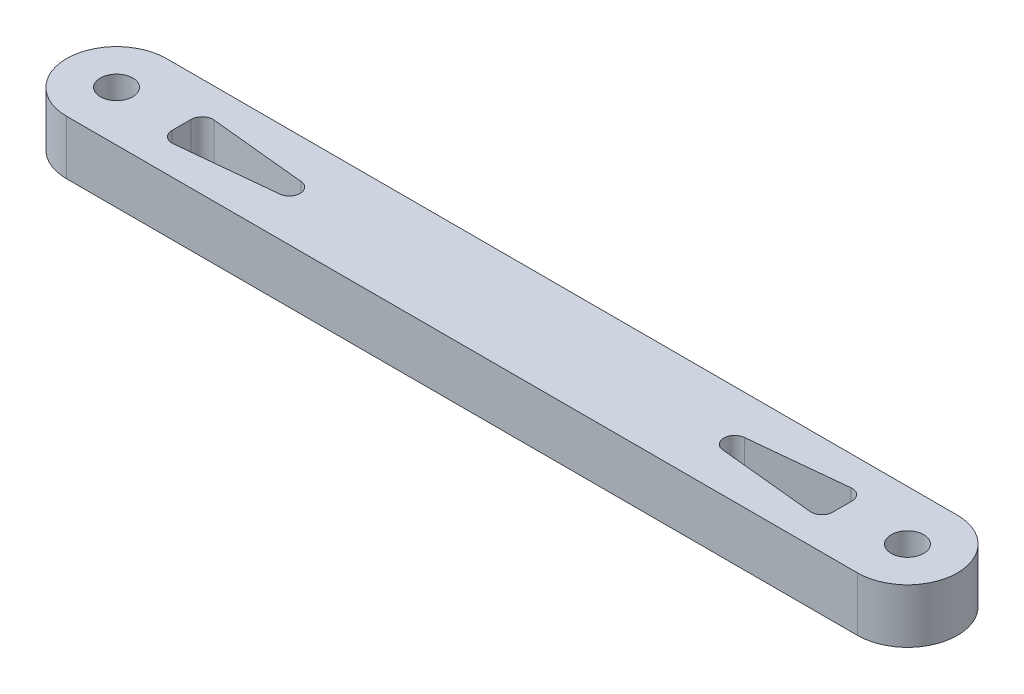
ISO-10303-21;
HEADER;
FILE_DESCRIPTION(('STEP AP214'),'2;1');
FILE_NAME('part.step','',(''),(''),'','','');
FILE_SCHEMA(('AUTOMOTIVE_DESIGN { 1 0 10303 214 1 1 1 1 }'));
ENDSEC;
DATA;
#1=APPLICATION_CONTEXT('core data for automotive mechanical design processes');
#2=APPLICATION_PROTOCOL_DEFINITION('international standard','automotive_design',2000,#1);
#3=PRODUCT_CONTEXT('',#1,'mechanical');
#4=PRODUCT('Part','Part','',(#3));
#5=PRODUCT_RELATED_PRODUCT_CATEGORY('part','',(#4));
#6=PRODUCT_DEFINITION_FORMATION('','',#4);
#7=PRODUCT_DEFINITION_CONTEXT('part definition',#1,'design');
#8=PRODUCT_DEFINITION('design','',#6,#7);
#9=PRODUCT_DEFINITION_SHAPE('','',#8);
#10=(LENGTH_UNIT() NAMED_UNIT(*) SI_UNIT(.MILLI.,.METRE.));
#11=(NAMED_UNIT(*) PLANE_ANGLE_UNIT() SI_UNIT($,.RADIAN.));
#12=(NAMED_UNIT(*) SI_UNIT($,.STERADIAN.) SOLID_ANGLE_UNIT());
#13=UNCERTAINTY_MEASURE_WITH_UNIT(LENGTH_MEASURE(1.E-05),#10,'distance_accuracy_value','');
#14=(GEOMETRIC_REPRESENTATION_CONTEXT(3) GLOBAL_UNCERTAINTY_ASSIGNED_CONTEXT((#13)) GLOBAL_UNIT_ASSIGNED_CONTEXT((#10,
#11,#12)) REPRESENTATION_CONTEXT('',''));
#15=CARTESIAN_POINT('',(0.,0.,0.));
#16=DIRECTION('',(0.,0.,1.));
#17=DIRECTION('',(1.,0.,0.));
#18=AXIS2_PLACEMENT_3D('',#15,#16,#17);
#19=CARTESIAN_POINT('',(73.,5.,0.));
#20=DIRECTION('',(0.,-1.,0.));
#21=DIRECTION('',(0.,0.,1.));
#22=AXIS2_PLACEMENT_3D('',#19,#20,#21);
#23=CYLINDRICAL_SURFACE('',#22,1.5);
#24=CARTESIAN_POINT('',(73.,5.,0.));
#25=DIRECTION('',(0.,-1.,0.));
#26=DIRECTION('',(0.,0.,-1.));
#27=AXIS2_PLACEMENT_3D('',#24,#25,#26);
#28=CIRCLE('',#27,1.5);
#29=CARTESIAN_POINT('',(73.,5.,-1.5));
#30=VERTEX_POINT('',#29);
#31=EDGE_CURVE('E167',#30,#30,#28,.T.);
#32=ORIENTED_EDGE('',*,*,#31,.F.);
#33=EDGE_LOOP('',(#32));
#34=FACE_BOUND('',#33,.T.);
#35=CARTESIAN_POINT('',(73.,0.,0.));
#36=DIRECTION('',(0.,-1.,0.));
#37=DIRECTION('',(0.,0.,-1.));
#38=AXIS2_PLACEMENT_3D('',#35,#36,#37);
#39=CIRCLE('',#38,1.5);
#40=CARTESIAN_POINT('',(73.,0.,-1.5));
#41=VERTEX_POINT('',#40);
#42=EDGE_CURVE('E291',#41,#41,#39,.T.);
#43=ORIENTED_EDGE('',*,*,#42,.T.);
#44=EDGE_LOOP('',(#43));
#45=FACE_BOUND('',#44,.T.);
#46=ADVANCED_FACE('F43',(#34,#45),#23,.F.);
#47=CARTESIAN_POINT('',(0.,0.,0.));
#48=DIRECTION('',(0.,1.,0.));
#49=DIRECTION('',(0.,0.,-1.));
#50=AXIS2_PLACEMENT_3D('',#47,#48,#49);
#51=PLANE('',#50);
#52=DIRECTION('',(0.,0.,-1.));
#53=VECTOR('',#52,1.);
#54=CARTESIAN_POINT('',(6.,0.,0.));
#55=LINE('',#54,#53);
#56=CARTESIAN_POINT('',(6.,0.,0.895012437887911));
#57=VERTEX_POINT('',#56);
#58=CARTESIAN_POINT('',(6.,0.,-0.895012437887911));
#59=VERTEX_POINT('',#58);
#60=EDGE_CURVE('E272',#57,#59,#55,.T.);
#61=ORIENTED_EDGE('',*,*,#60,.F.);
#62=CARTESIAN_POINT('',(7.,0.,0.895012437887911));
#63=DIRECTION('',(0.,-1.,0.));
#64=DIRECTION('',(0.,0.,-1.));
#65=AXIS2_PLACEMENT_3D('',#62,#63,#64);
#66=CIRCLE('',#65,1.);
#67=CARTESIAN_POINT('',(7.099503719021,0.,1.8900496280979));
#68=VERTEX_POINT('',#67);
#69=EDGE_CURVE('E11',#68,#57,#66,.T.);
#70=ORIENTED_EDGE('',*,*,#69,.F.);
#71=DIRECTION('',(-0.995037190209989,0.,0.0995037190209989));
#72=VECTOR('',#71,1.);
#73=CARTESIAN_POINT('',(0.257425742574257,0.,2.57425742574257));
#74=LINE('',#73,#72);
#75=CARTESIAN_POINT('',(16.0496280979001,0.,0.995037190209989));
#76=VERTEX_POINT('',#75);
#77=EDGE_CURVE('E277',#76,#68,#74,.T.);
#78=ORIENTED_EDGE('',*,*,#77,.F.);
#79=CARTESIAN_POINT('',(15.9501243788791,0.,0.));
#80=DIRECTION('',(0.,-1.,0.));
#81=DIRECTION('',(0.,0.,-1.));
#82=AXIS2_PLACEMENT_3D('',#79,#80,#81);
#83=CIRCLE('',#82,1.);
#84=CARTESIAN_POINT('',(16.0496280979001,0.,-0.995037190209989));
#85=VERTEX_POINT('',#84);
#86=EDGE_CURVE('E229',#85,#76,#83,.T.);
#87=ORIENTED_EDGE('',*,*,#86,.F.);
#88=DIRECTION('',(0.995037190209989,0.,0.0995037190209989));
#89=VECTOR('',#88,1.);
#90=CARTESIAN_POINT('',(0.257425742574257,0.,-2.57425742574257));
#91=LINE('',#90,#89);
#92=CARTESIAN_POINT('',(7.099503719021,0.,-1.8900496280979));
#93=VERTEX_POINT('',#92);
#94=EDGE_CURVE('E274',#93,#85,#91,.T.);
#95=ORIENTED_EDGE('',*,*,#94,.F.);
#96=CARTESIAN_POINT('',(7.,0.,-0.895012437887911));
#97=DIRECTION('',(0.,-1.,0.));
#98=DIRECTION('',(0.,0.,-1.));
#99=AXIS2_PLACEMENT_3D('',#96,#97,#98);
#100=CIRCLE('',#99,1.);
#101=EDGE_CURVE('E234',#59,#93,#100,.T.);
#102=ORIENTED_EDGE('',*,*,#101,.F.);
#103=EDGE_LOOP('',(#61,#70,#78,#87,#95,#102));
#104=FACE_BOUND('',#103,.T.);
#105=DIRECTION('',(0.995037190209989,0.,-0.0995037190209994));
#106=VECTOR('',#105,1.);
#107=CARTESIAN_POINT('',(0.46534653465347,0.,4.65346534653468));
#108=LINE('',#107,#106);
#109=CARTESIAN_POINT('',(56.9503719020999,0.,-0.995037190209986));
#110=VERTEX_POINT('',#109);
#111=CARTESIAN_POINT('',(65.900496280979,0.,-1.89004962809791));
#112=VERTEX_POINT('',#111);
#113=EDGE_CURVE('E258',#110,#112,#108,.T.);
#114=ORIENTED_EDGE('',*,*,#113,.F.);
#115=CARTESIAN_POINT('',(57.0498756211208,0.,0.));
#116=DIRECTION('',(0.,-1.,0.));
#117=DIRECTION('',(0.,0.,-1.));
#118=AXIS2_PLACEMENT_3D('',#115,#116,#117);
#119=CIRCLE('',#118,1.);
#120=CARTESIAN_POINT('',(56.9503719020999,0.,0.995037190209991));
#121=VERTEX_POINT('',#120);
#122=EDGE_CURVE('E223',#121,#110,#119,.T.);
#123=ORIENTED_EDGE('',*,*,#122,.F.);
#124=DIRECTION('',(-0.995037190209989,0.,-0.0995037190209991));
#125=VECTOR('',#124,1.);
#126=CARTESIAN_POINT('',(0.465346534653467,0.,-4.65346534653466));
#127=LINE('',#126,#125);
#128=CARTESIAN_POINT('',(65.900496280979,0.,1.89004962809791));
#129=VERTEX_POINT('',#128);
#130=EDGE_CURVE('E269',#129,#121,#127,.T.);
#131=ORIENTED_EDGE('',*,*,#130,.F.);
#132=CARTESIAN_POINT('',(66.,0.,0.895012437887918));
#133=DIRECTION('',(0.,-1.,0.));
#134=DIRECTION('',(0.,0.,-1.));
#135=AXIS2_PLACEMENT_3D('',#132,#133,#134);
#136=CIRCLE('',#135,1.);
#137=CARTESIAN_POINT('',(67.,0.,0.895012437887918));
#138=VERTEX_POINT('',#137);
#139=EDGE_CURVE('E217',#138,#129,#136,.T.);
#140=ORIENTED_EDGE('',*,*,#139,.F.);
#141=DIRECTION('',(0.,0.,1.));
#142=VECTOR('',#141,1.);
#143=CARTESIAN_POINT('',(67.,0.,0.));
#144=LINE('',#143,#142);
#145=CARTESIAN_POINT('',(67.,0.,-0.895012437887918));
#146=VERTEX_POINT('',#145);
#147=EDGE_CURVE('E266',#146,#138,#144,.T.);
#148=ORIENTED_EDGE('',*,*,#147,.F.);
#149=CARTESIAN_POINT('',(66.,0.,-0.895012437887918));
#150=DIRECTION('',(0.,-1.,0.));
#151=DIRECTION('',(0.,0.,-1.));
#152=AXIS2_PLACEMENT_3D('',#149,#150,#151);
#153=CIRCLE('',#152,1.);
#154=EDGE_CURVE('E211',#112,#146,#153,.T.);
#155=ORIENTED_EDGE('',*,*,#154,.F.);
#156=EDGE_LOOP('',(#114,#123,#131,#140,#148,#155));
#157=FACE_BOUND('',#156,.T.);
#158=CARTESIAN_POINT('',(0.,0.,0.));
#159=DIRECTION('',(0.,-1.,0.));
#160=DIRECTION('',(0.,0.,-1.));
#161=AXIS2_PLACEMENT_3D('',#158,#159,#160);
#162=CIRCLE('',#161,1.5);
#163=CARTESIAN_POINT('',(0.,0.,-1.5));
#164=VERTEX_POINT('',#163);
#165=EDGE_CURVE('E279',#164,#164,#162,.T.);
#166=ORIENTED_EDGE('',*,*,#165,.F.);
#167=EDGE_LOOP('',(#166));
#168=FACE_BOUND('',#167,.T.);
#169=ORIENTED_EDGE('',*,*,#42,.F.);
#170=EDGE_LOOP('',(#169));
#171=FACE_BOUND('',#170,.T.);
#172=DIRECTION('',(1.,0.,0.));
#173=VECTOR('',#172,1.);
#174=CARTESIAN_POINT('',(0.,0.,-4.61059088650664));
#175=LINE('',#174,#173);
#176=CARTESIAN_POINT('',(0.,0.,-4.61059088650664));
#177=VERTEX_POINT('',#176);
#178=CARTESIAN_POINT('',(73.,0.,-4.61059088650664));
#179=VERTEX_POINT('',#178);
#180=EDGE_CURVE('E294',#177,#179,#175,.T.);
#181=ORIENTED_EDGE('',*,*,#180,.T.);
#182=CARTESIAN_POINT('',(73.,0.,0.));
#183=DIRECTION('',(0.,-1.,0.));
#184=DIRECTION('',(0.,0.,-1.));
#185=AXIS2_PLACEMENT_3D('',#182,#183,#184);
#186=CIRCLE('',#185,4.61059088650664);
#187=CARTESIAN_POINT('',(73.,0.,4.61059088650664));
#188=VERTEX_POINT('',#187);
#189=EDGE_CURVE('E178',#179,#188,#186,.T.);
#190=ORIENTED_EDGE('',*,*,#189,.T.);
#191=DIRECTION('',(1.,0.,0.));
#192=VECTOR('',#191,1.);
#193=CARTESIAN_POINT('',(0.,0.,4.61059088650664));
#194=LINE('',#193,#192);
#195=CARTESIAN_POINT('',(0.,0.,4.61059088650664));
#196=VERTEX_POINT('',#195);
#197=EDGE_CURVE('E297',#196,#188,#194,.T.);
#198=ORIENTED_EDGE('',*,*,#197,.F.);
#199=CARTESIAN_POINT('',(0.,0.,0.));
#200=DIRECTION('',(0.,-1.,0.));
#201=DIRECTION('',(0.,0.,-1.));
#202=AXIS2_PLACEMENT_3D('',#199,#200,#201);
#203=CIRCLE('',#202,4.61059088650664);
#204=EDGE_CURVE('E283',#196,#177,#203,.T.);
#205=ORIENTED_EDGE('',*,*,#204,.T.);
#206=EDGE_LOOP('',(#181,#190,#198,#205));
#207=FACE_BOUND('',#206,.T.);
#208=ADVANCED_FACE('F310',(#104,#157,#168,#171,#207),#51,.F.);
#209=CARTESIAN_POINT('',(0.,5.,0.));
#210=DIRECTION('',(0.,-1.,0.));
#211=DIRECTION('',(0.,0.,1.));
#212=AXIS2_PLACEMENT_3D('',#209,#210,#211);
#213=CYLINDRICAL_SURFACE('',#212,1.5);
#214=CARTESIAN_POINT('',(0.,5.,0.));
#215=DIRECTION('',(0.,-1.,0.));
#216=DIRECTION('',(0.,0.,-1.));
#217=AXIS2_PLACEMENT_3D('',#214,#215,#216);
#218=CIRCLE('',#217,1.5);
#219=CARTESIAN_POINT('',(0.,5.,-1.5));
#220=VERTEX_POINT('',#219);
#221=EDGE_CURVE('E280',#220,#220,#218,.T.);
#222=ORIENTED_EDGE('',*,*,#221,.F.);
#223=EDGE_LOOP('',(#222));
#224=FACE_BOUND('',#223,.T.);
#225=ORIENTED_EDGE('',*,*,#165,.T.);
#226=EDGE_LOOP('',(#225));
#227=FACE_BOUND('',#226,.T.);
#228=ADVANCED_FACE('F312',(#224,#227),#213,.F.);
#229=CARTESIAN_POINT('',(0.,5.,4.61059088650664));
#230=DIRECTION('',(0.,0.,1.));
#231=DIRECTION('',(-1.,0.,0.));
#232=AXIS2_PLACEMENT_3D('',#229,#230,#231);
#233=PLANE('',#232);
#234=ORIENTED_EDGE('',*,*,#197,.T.);
#235=DIRECTION('',(0.,-1.,0.));
#236=VECTOR('',#235,1.);
#237=CARTESIAN_POINT('',(73.,5.,4.61059088650664));
#238=LINE('',#237,#236);
#239=CARTESIAN_POINT('',(73.,5.,4.61059088650664));
#240=VERTEX_POINT('',#239);
#241=EDGE_CURVE('E181',#240,#188,#238,.T.);
#242=ORIENTED_EDGE('',*,*,#241,.F.);
#243=DIRECTION('',(1.,0.,0.));
#244=VECTOR('',#243,1.);
#245=CARTESIAN_POINT('',(0.,5.,4.61059088650664));
#246=LINE('',#245,#244);
#247=CARTESIAN_POINT('',(0.,5.,4.61059088650664));
#248=VERTEX_POINT('',#247);
#249=EDGE_CURVE('E172',#248,#240,#246,.T.);
#250=ORIENTED_EDGE('',*,*,#249,.F.);
#251=DIRECTION('',(0.,-1.,0.));
#252=VECTOR('',#251,1.);
#253=CARTESIAN_POINT('',(0.,5.,4.61059088650664));
#254=LINE('',#253,#252);
#255=EDGE_CURVE('E185',#248,#196,#254,.T.);
#256=ORIENTED_EDGE('',*,*,#255,.T.);
#257=EDGE_LOOP('',(#234,#242,#250,#256));
#258=FACE_BOUND('',#257,.T.);
#259=ADVANCED_FACE('F305',(#258),#233,.T.);
#260=CARTESIAN_POINT('',(73.,5.,0.));
#261=DIRECTION('',(0.,-1.,0.));
#262=DIRECTION('',(0.,0.,1.));
#263=AXIS2_PLACEMENT_3D('',#260,#261,#262);
#264=CYLINDRICAL_SURFACE('',#263,4.61059088650664);
#265=ORIENTED_EDGE('',*,*,#189,.F.);
#266=DIRECTION('',(0.,-1.,0.));
#267=VECTOR('',#266,1.);
#268=CARTESIAN_POINT('',(73.,5.,-4.61059088650664));
#269=LINE('',#268,#267);
#270=CARTESIAN_POINT('',(73.,5.,-4.61059088650664));
#271=VERTEX_POINT('',#270);
#272=EDGE_CURVE('E162',#271,#179,#269,.T.);
#273=ORIENTED_EDGE('',*,*,#272,.F.);
#274=CARTESIAN_POINT('',(73.,5.,0.));
#275=DIRECTION('',(0.,-1.,0.));
#276=DIRECTION('',(0.,0.,-1.));
#277=AXIS2_PLACEMENT_3D('',#274,#275,#276);
#278=CIRCLE('',#277,4.61059088650664);
#279=EDGE_CURVE('E166',#271,#240,#278,.T.);
#280=ORIENTED_EDGE('',*,*,#279,.T.);
#281=ORIENTED_EDGE('',*,*,#241,.T.);
#282=EDGE_LOOP('',(#265,#273,#280,#281));
#283=FACE_BOUND('',#282,.T.);
#284=ADVANCED_FACE('F176',(#283),#264,.T.);
#285=CARTESIAN_POINT('',(0.,5.,-4.61059088650664));
#286=DIRECTION('',(0.,0.,1.));
#287=DIRECTION('',(-1.,0.,0.));
#288=AXIS2_PLACEMENT_3D('',#285,#286,#287);
#289=PLANE('',#288);
#290=ORIENTED_EDGE('',*,*,#180,.F.);
#291=DIRECTION('',(0.,-1.,0.));
#292=VECTOR('',#291,1.);
#293=CARTESIAN_POINT('',(0.,5.,-4.61059088650664));
#294=LINE('',#293,#292);
#295=CARTESIAN_POINT('',(0.,5.,-4.61059088650664));
#296=VERTEX_POINT('',#295);
#297=EDGE_CURVE('E164',#296,#177,#294,.T.);
#298=ORIENTED_EDGE('',*,*,#297,.F.);
#299=DIRECTION('',(1.,0.,0.));
#300=VECTOR('',#299,1.);
#301=CARTESIAN_POINT('',(0.,5.,-4.61059088650664));
#302=LINE('',#301,#300);
#303=EDGE_CURVE('E157',#296,#271,#302,.T.);
#304=ORIENTED_EDGE('',*,*,#303,.T.);
#305=ORIENTED_EDGE('',*,*,#272,.T.);
#306=EDGE_LOOP('',(#290,#298,#304,#305));
#307=FACE_BOUND('',#306,.T.);
#308=ADVANCED_FACE('F160',(#307),#289,.F.);
#309=CARTESIAN_POINT('',(0.,5.,0.));
#310=DIRECTION('',(0.,-1.,0.));
#311=DIRECTION('',(0.,0.,1.));
#312=AXIS2_PLACEMENT_3D('',#309,#310,#311);
#313=CYLINDRICAL_SURFACE('',#312,4.61059088650664);
#314=ORIENTED_EDGE('',*,*,#204,.F.);
#315=ORIENTED_EDGE('',*,*,#255,.F.);
#316=CARTESIAN_POINT('',(0.,5.,0.));
#317=DIRECTION('',(0.,-1.,0.));
#318=DIRECTION('',(0.,0.,-1.));
#319=AXIS2_PLACEMENT_3D('',#316,#317,#318);
#320=CIRCLE('',#319,4.61059088650664);
#321=EDGE_CURVE('E287',#248,#296,#320,.T.);
#322=ORIENTED_EDGE('',*,*,#321,.T.);
#323=ORIENTED_EDGE('',*,*,#297,.T.);
#324=EDGE_LOOP('',(#314,#315,#322,#323));
#325=FACE_BOUND('',#324,.T.);
#326=ADVANCED_FACE('F308',(#325),#313,.T.);
#327=CARTESIAN_POINT('',(0.,5.,0.));
#328=DIRECTION('',(0.,1.,0.));
#329=DIRECTION('',(0.,0.,-1.));
#330=AXIS2_PLACEMENT_3D('',#327,#328,#329);
#331=PLANE('',#330);
#332=DIRECTION('',(-0.995037190209989,0.,0.0995037190209989));
#333=VECTOR('',#332,1.);
#334=CARTESIAN_POINT('',(6.,5.,2.));
#335=LINE('',#334,#333);
#336=CARTESIAN_POINT('',(16.0496280979001,5.,0.995037190209989));
#337=VERTEX_POINT('',#336);
#338=CARTESIAN_POINT('',(7.099503719021,5.,1.8900496280979));
#339=VERTEX_POINT('',#338);
#340=EDGE_CURVE('E244',#337,#339,#335,.T.);
#341=ORIENTED_EDGE('',*,*,#340,.T.);
#342=CARTESIAN_POINT('',(7.,5.,0.895012437887911));
#343=DIRECTION('',(0.,-1.,0.));
#344=DIRECTION('',(0.,0.,-1.));
#345=AXIS2_PLACEMENT_3D('',#342,#343,#344);
#346=CIRCLE('',#345,1.);
#347=CARTESIAN_POINT('',(6.,5.,0.895012437887911));
#348=VERTEX_POINT('',#347);
#349=EDGE_CURVE('E51',#348,#339,#346,.F.);
#350=ORIENTED_EDGE('',*,*,#349,.F.);
#351=DIRECTION('',(0.,0.,-1.));
#352=VECTOR('',#351,1.);
#353=CARTESIAN_POINT('',(6.,5.,2.));
#354=LINE('',#353,#352);
#355=CARTESIAN_POINT('',(6.,5.,-0.895012437887911));
#356=VERTEX_POINT('',#355);
#357=EDGE_CURVE('E248',#348,#356,#354,.T.);
#358=ORIENTED_EDGE('',*,*,#357,.T.);
#359=CARTESIAN_POINT('',(7.,5.,-0.895012437887911));
#360=DIRECTION('',(0.,-1.,0.));
#361=DIRECTION('',(0.,0.,-1.));
#362=AXIS2_PLACEMENT_3D('',#359,#360,#361);
#363=CIRCLE('',#362,1.);
#364=CARTESIAN_POINT('',(7.099503719021,5.,-1.8900496280979));
#365=VERTEX_POINT('',#364);
#366=EDGE_CURVE('E232',#365,#356,#363,.F.);
#367=ORIENTED_EDGE('',*,*,#366,.F.);
#368=DIRECTION('',(0.995037190209989,0.,0.0995037190209989));
#369=VECTOR('',#368,1.);
#370=CARTESIAN_POINT('',(6.,5.,-2.));
#371=LINE('',#370,#369);
#372=CARTESIAN_POINT('',(16.0496280979001,5.,-0.995037190209989));
#373=VERTEX_POINT('',#372);
#374=EDGE_CURVE('E251',#365,#373,#371,.T.);
#375=ORIENTED_EDGE('',*,*,#374,.T.);
#376=CARTESIAN_POINT('',(15.9501243788791,5.,0.));
#377=DIRECTION('',(0.,-1.,0.));
#378=DIRECTION('',(0.,0.,-1.));
#379=AXIS2_PLACEMENT_3D('',#376,#377,#378);
#380=CIRCLE('',#379,1.);
#381=EDGE_CURVE('E226',#337,#373,#380,.F.);
#382=ORIENTED_EDGE('',*,*,#381,.F.);
#383=EDGE_LOOP('',(#341,#350,#358,#367,#375,#382));
#384=FACE_BOUND('',#383,.T.);
#385=DIRECTION('',(-0.995037190209989,0.,-0.0995037190209991));
#386=VECTOR('',#385,1.);
#387=CARTESIAN_POINT('',(67.,5.,2.00000000000001));
#388=LINE('',#387,#386);
#389=CARTESIAN_POINT('',(65.900496280979,5.,1.89004962809791));
#390=VERTEX_POINT('',#389);
#391=CARTESIAN_POINT('',(56.9503719020999,5.,0.99503719020999));
#392=VERTEX_POINT('',#391);
#393=EDGE_CURVE('E249',#390,#392,#388,.T.);
#394=ORIENTED_EDGE('',*,*,#393,.T.);
#395=CARTESIAN_POINT('',(57.0498756211208,5.,0.));
#396=DIRECTION('',(0.,-1.,0.));
#397=DIRECTION('',(0.,0.,-1.));
#398=AXIS2_PLACEMENT_3D('',#395,#396,#397);
#399=CIRCLE('',#398,1.);
#400=CARTESIAN_POINT('',(56.9503719020999,5.,-0.995037190209988));
#401=VERTEX_POINT('',#400);
#402=EDGE_CURVE('E220',#401,#392,#399,.F.);
#403=ORIENTED_EDGE('',*,*,#402,.F.);
#404=DIRECTION('',(0.995037190209989,0.,-0.0995037190209994));
#405=VECTOR('',#404,1.);
#406=CARTESIAN_POINT('',(67.,5.,-2.00000000000001));
#407=LINE('',#406,#405);
#408=CARTESIAN_POINT('',(65.900496280979,5.,-1.89004962809791));
#409=VERTEX_POINT('',#408);
#410=EDGE_CURVE('E254',#401,#409,#407,.T.);
#411=ORIENTED_EDGE('',*,*,#410,.T.);
#412=CARTESIAN_POINT('',(66.,5.,-0.895012437887918));
#413=DIRECTION('',(0.,-1.,0.));
#414=DIRECTION('',(0.,0.,-1.));
#415=AXIS2_PLACEMENT_3D('',#412,#413,#414);
#416=CIRCLE('',#415,1.);
#417=CARTESIAN_POINT('',(67.,5.,-0.895012437887918));
#418=VERTEX_POINT('',#417);
#419=EDGE_CURVE('E208',#418,#409,#416,.F.);
#420=ORIENTED_EDGE('',*,*,#419,.F.);
#421=DIRECTION('',(0.,0.,1.));
#422=VECTOR('',#421,1.);
#423=CARTESIAN_POINT('',(67.,5.,2.00000000000001));
#424=LINE('',#423,#422);
#425=CARTESIAN_POINT('',(67.,5.,0.895012437887918));
#426=VERTEX_POINT('',#425);
#427=EDGE_CURVE('E259',#418,#426,#424,.T.);
#428=ORIENTED_EDGE('',*,*,#427,.T.);
#429=CARTESIAN_POINT('',(66.,5.,0.895012437887918));
#430=DIRECTION('',(0.,-1.,0.));
#431=DIRECTION('',(0.,0.,-1.));
#432=AXIS2_PLACEMENT_3D('',#429,#430,#431);
#433=CIRCLE('',#432,1.);
#434=EDGE_CURVE('E214',#390,#426,#433,.F.);
#435=ORIENTED_EDGE('',*,*,#434,.F.);
#436=EDGE_LOOP('',(#394,#403,#411,#420,#428,#435));
#437=FACE_BOUND('',#436,.T.);
#438=ORIENTED_EDGE('',*,*,#221,.T.);
#439=EDGE_LOOP('',(#438));
#440=FACE_BOUND('',#439,.T.);
#441=ORIENTED_EDGE('',*,*,#31,.T.);
#442=EDGE_LOOP('',(#441));
#443=FACE_BOUND('',#442,.T.);
#444=ORIENTED_EDGE('',*,*,#303,.F.);
#445=ORIENTED_EDGE('',*,*,#321,.F.);
#446=ORIENTED_EDGE('',*,*,#249,.T.);
#447=ORIENTED_EDGE('',*,*,#279,.F.);
#448=EDGE_LOOP('',(#444,#445,#446,#447));
#449=FACE_BOUND('',#448,.T.);
#450=ADVANCED_FACE('F170',(#384,#437,#440,#443,#449),#331,.T.);
#451=CARTESIAN_POINT('',(67.,-12.,2.00000000000001));
#452=DIRECTION('',(-0.0995037190209991,0.,0.995037190209989));
#453=DIRECTION('',(-0.995037190209989,0.,-0.0995037190209991));
#454=AXIS2_PLACEMENT_3D('',#451,#452,#453);
#455=PLANE('',#454);
#456=ORIENTED_EDGE('',*,*,#130,.T.);
#457=DIRECTION('',(0.,1.,0.));
#458=VECTOR('',#457,1.);
#459=CARTESIAN_POINT('',(56.9503719020999,0.,0.99503719020999));
#460=LINE('',#459,#458);
#461=EDGE_CURVE('E194',#392,#121,#460,.F.);
#462=ORIENTED_EDGE('',*,*,#461,.F.);
#463=ORIENTED_EDGE('',*,*,#393,.F.);
#464=DIRECTION('',(0.,1.,0.));
#465=VECTOR('',#464,1.);
#466=CARTESIAN_POINT('',(65.900496280979,4.99999999999999,1.89004962809791));
#467=LINE('',#466,#465);
#468=EDGE_CURVE('E196',#129,#390,#467,.T.);
#469=ORIENTED_EDGE('',*,*,#468,.F.);
#470=EDGE_LOOP('',(#456,#462,#463,#469));
#471=FACE_BOUND('',#470,.T.);
#472=ADVANCED_FACE('F379',(#471),#455,.F.);
#473=CARTESIAN_POINT('',(67.,-12.,2.00000000000001));
#474=DIRECTION('',(1.,0.,0.));
#475=DIRECTION('',(0.,0.,1.));
#476=AXIS2_PLACEMENT_3D('',#473,#474,#475);
#477=PLANE('',#476);
#478=ORIENTED_EDGE('',*,*,#147,.T.);
#479=DIRECTION('',(0.,1.,0.));
#480=VECTOR('',#479,1.);
#481=CARTESIAN_POINT('',(67.,0.,0.895012437887918));
#482=LINE('',#481,#480);
#483=EDGE_CURVE('E180',#426,#138,#482,.F.);
#484=ORIENTED_EDGE('',*,*,#483,.F.);
#485=ORIENTED_EDGE('',*,*,#427,.F.);
#486=DIRECTION('',(0.,1.,0.));
#487=VECTOR('',#486,1.);
#488=CARTESIAN_POINT('',(67.,4.99999999999999,-0.895012437887918));
#489=LINE('',#488,#487);
#490=EDGE_CURVE('E183',#146,#418,#489,.T.);
#491=ORIENTED_EDGE('',*,*,#490,.F.);
#492=EDGE_LOOP('',(#478,#484,#485,#491));
#493=FACE_BOUND('',#492,.T.);
#494=ADVANCED_FACE('F374',(#493),#477,.F.);
#495=CARTESIAN_POINT('',(67.,-12.,-2.00000000000001));
#496=DIRECTION('',(-0.0995037190209994,0.,-0.995037190209989));
#497=DIRECTION('',(0.995037190209989,0.,-0.0995037190209994));
#498=AXIS2_PLACEMENT_3D('',#495,#496,#497);
#499=PLANE('',#498);
#500=ORIENTED_EDGE('',*,*,#410,.F.);
#501=DIRECTION('',(0.,1.,0.));
#502=VECTOR('',#501,1.);
#503=CARTESIAN_POINT('',(56.9503719020999,5.,-0.995037190209988));
#504=LINE('',#503,#502);
#505=EDGE_CURVE('E190',#110,#401,#504,.T.);
#506=ORIENTED_EDGE('',*,*,#505,.F.);
#507=ORIENTED_EDGE('',*,*,#113,.T.);
#508=DIRECTION('',(0.,1.,0.));
#509=VECTOR('',#508,1.);
#510=CARTESIAN_POINT('',(65.900496280979,0.,-1.89004962809791));
#511=LINE('',#510,#509);
#512=EDGE_CURVE('E192',#409,#112,#511,.F.);
#513=ORIENTED_EDGE('',*,*,#512,.F.);
#514=EDGE_LOOP('',(#500,#506,#507,#513));
#515=FACE_BOUND('',#514,.T.);
#516=ADVANCED_FACE('F367',(#515),#499,.F.);
#517=CARTESIAN_POINT('',(6.,-12.,2.));
#518=DIRECTION('',(0.0995037190209989,0.,0.995037190209989));
#519=DIRECTION('',(-0.995037190209989,0.,0.0995037190209989));
#520=AXIS2_PLACEMENT_3D('',#517,#518,#519);
#521=PLANE('',#520);
#522=ORIENTED_EDGE('',*,*,#77,.T.);
#523=DIRECTION('',(0.,1.,0.));
#524=VECTOR('',#523,1.);
#525=CARTESIAN_POINT('',(7.099503719021,0.,1.8900496280979));
#526=LINE('',#525,#524);
#527=EDGE_CURVE('E198',#339,#68,#526,.F.);
#528=ORIENTED_EDGE('',*,*,#527,.F.);
#529=ORIENTED_EDGE('',*,*,#340,.F.);
#530=DIRECTION('',(0.,1.,0.));
#531=VECTOR('',#530,1.);
#532=CARTESIAN_POINT('',(16.0496280979001,5.,0.995037190209989));
#533=LINE('',#532,#531);
#534=EDGE_CURVE('E200',#76,#337,#533,.T.);
#535=ORIENTED_EDGE('',*,*,#534,.F.);
#536=EDGE_LOOP('',(#522,#528,#529,#535));
#537=FACE_BOUND('',#536,.T.);
#538=ADVANCED_FACE('F365',(#537),#521,.F.);
#539=CARTESIAN_POINT('',(6.,-12.,-2.));
#540=DIRECTION('',(0.0995037190209989,0.,-0.995037190209989));
#541=DIRECTION('',(0.995037190209989,0.,0.0995037190209989));
#542=AXIS2_PLACEMENT_3D('',#539,#540,#541);
#543=PLANE('',#542);
#544=ORIENTED_EDGE('',*,*,#374,.F.);
#545=DIRECTION('',(0.,1.,0.));
#546=VECTOR('',#545,1.);
#547=CARTESIAN_POINT('',(7.099503719021,4.99999999999999,-1.8900496280979));
#548=LINE('',#547,#546);
#549=EDGE_CURVE('E202',#93,#365,#548,.T.);
#550=ORIENTED_EDGE('',*,*,#549,.F.);
#551=ORIENTED_EDGE('',*,*,#94,.T.);
#552=DIRECTION('',(0.,1.,0.));
#553=VECTOR('',#552,1.);
#554=CARTESIAN_POINT('',(16.0496280979001,0.,-0.995037190209989));
#555=LINE('',#554,#553);
#556=EDGE_CURVE('E204',#373,#85,#555,.F.);
#557=ORIENTED_EDGE('',*,*,#556,.F.);
#558=EDGE_LOOP('',(#544,#550,#551,#557));
#559=FACE_BOUND('',#558,.T.);
#560=ADVANCED_FACE('F362',(#559),#543,.F.);
#561=CARTESIAN_POINT('',(6.,-12.,2.));
#562=DIRECTION('',(-1.,0.,0.));
#563=DIRECTION('',(0.,0.,-1.));
#564=AXIS2_PLACEMENT_3D('',#561,#562,#563);
#565=PLANE('',#564);
#566=ORIENTED_EDGE('',*,*,#357,.F.);
#567=DIRECTION('',(0.,1.,0.));
#568=VECTOR('',#567,1.);
#569=CARTESIAN_POINT('',(6.,4.99999999999999,0.895012437887911));
#570=LINE('',#569,#568);
#571=EDGE_CURVE('E66',#57,#348,#570,.T.);
#572=ORIENTED_EDGE('',*,*,#571,.F.);
#573=ORIENTED_EDGE('',*,*,#60,.T.);
#574=DIRECTION('',(0.,1.,0.));
#575=VECTOR('',#574,1.);
#576=CARTESIAN_POINT('',(6.,0.,-0.895012437887911));
#577=LINE('',#576,#575);
#578=EDGE_CURVE('E58',#356,#59,#577,.F.);
#579=ORIENTED_EDGE('',*,*,#578,.F.);
#580=EDGE_LOOP('',(#566,#572,#573,#579));
#581=FACE_BOUND('',#580,.T.);
#582=ADVANCED_FACE('F340',(#581),#565,.F.);
#583=CARTESIAN_POINT('',(66.,-12.,-0.895012437887918));
#584=DIRECTION('',(0.,-1.,0.));
#585=DIRECTION('',(0.,0.,1.));
#586=AXIS2_PLACEMENT_3D('',#583,#584,#585);
#587=CYLINDRICAL_SURFACE('',#586,1.);
#588=ORIENTED_EDGE('',*,*,#154,.T.);
#589=ORIENTED_EDGE('',*,*,#490,.T.);
#590=ORIENTED_EDGE('',*,*,#419,.T.);
#591=ORIENTED_EDGE('',*,*,#512,.T.);
#592=EDGE_LOOP('',(#588,#589,#590,#591));
#593=FACE_BOUND('',#592,.T.);
#594=ADVANCED_FACE('F336',(#593),#587,.F.);
#595=CARTESIAN_POINT('',(66.,-12.,0.895012437887918));
#596=DIRECTION('',(0.,-1.,0.));
#597=DIRECTION('',(0.,0.,1.));
#598=AXIS2_PLACEMENT_3D('',#595,#596,#597);
#599=CYLINDRICAL_SURFACE('',#598,1.);
#600=ORIENTED_EDGE('',*,*,#139,.T.);
#601=ORIENTED_EDGE('',*,*,#468,.T.);
#602=ORIENTED_EDGE('',*,*,#434,.T.);
#603=ORIENTED_EDGE('',*,*,#483,.T.);
#604=EDGE_LOOP('',(#600,#601,#602,#603));
#605=FACE_BOUND('',#604,.T.);
#606=ADVANCED_FACE('F339',(#605),#599,.F.);
#607=CARTESIAN_POINT('',(57.0498756211208,-12.,0.));
#608=DIRECTION('',(0.,-1.,0.));
#609=DIRECTION('',(0.,0.,1.));
#610=AXIS2_PLACEMENT_3D('',#607,#608,#609);
#611=CYLINDRICAL_SURFACE('',#610,1.);
#612=ORIENTED_EDGE('',*,*,#122,.T.);
#613=ORIENTED_EDGE('',*,*,#505,.T.);
#614=ORIENTED_EDGE('',*,*,#402,.T.);
#615=ORIENTED_EDGE('',*,*,#461,.T.);
#616=EDGE_LOOP('',(#612,#613,#614,#615));
#617=FACE_BOUND('',#616,.T.);
#618=ADVANCED_FACE('F344',(#617),#611,.F.);
#619=CARTESIAN_POINT('',(15.9501243788791,-12.,0.));
#620=DIRECTION('',(0.,-1.,0.));
#621=DIRECTION('',(0.,0.,1.));
#622=AXIS2_PLACEMENT_3D('',#619,#620,#621);
#623=CYLINDRICAL_SURFACE('',#622,1.);
#624=ORIENTED_EDGE('',*,*,#86,.T.);
#625=ORIENTED_EDGE('',*,*,#534,.T.);
#626=ORIENTED_EDGE('',*,*,#381,.T.);
#627=ORIENTED_EDGE('',*,*,#556,.T.);
#628=EDGE_LOOP('',(#624,#625,#626,#627));
#629=FACE_BOUND('',#628,.T.);
#630=ADVANCED_FACE('F348',(#629),#623,.F.);
#631=CARTESIAN_POINT('',(7.,-12.,-0.895012437887911));
#632=DIRECTION('',(0.,-1.,0.));
#633=DIRECTION('',(0.,0.,1.));
#634=AXIS2_PLACEMENT_3D('',#631,#632,#633);
#635=CYLINDRICAL_SURFACE('',#634,1.);
#636=ORIENTED_EDGE('',*,*,#101,.T.);
#637=ORIENTED_EDGE('',*,*,#549,.T.);
#638=ORIENTED_EDGE('',*,*,#366,.T.);
#639=ORIENTED_EDGE('',*,*,#578,.T.);
#640=EDGE_LOOP('',(#636,#637,#638,#639));
#641=FACE_BOUND('',#640,.T.);
#642=ADVANCED_FACE('F351',(#641),#635,.F.);
#643=CARTESIAN_POINT('',(7.,-12.,0.895012437887911));
#644=DIRECTION('',(0.,-1.,0.));
#645=DIRECTION('',(0.,0.,1.));
#646=AXIS2_PLACEMENT_3D('',#643,#644,#645);
#647=CYLINDRICAL_SURFACE('',#646,1.);
#648=ORIENTED_EDGE('',*,*,#69,.T.);
#649=ORIENTED_EDGE('',*,*,#571,.T.);
#650=ORIENTED_EDGE('',*,*,#349,.T.);
#651=ORIENTED_EDGE('',*,*,#527,.T.);
#652=EDGE_LOOP('',(#648,#649,#650,#651));
#653=FACE_BOUND('',#652,.T.);
#654=ADVANCED_FACE('F45',(#653),#647,.F.);
#655=CLOSED_SHELL('',(#46,#208,#228,#259,#284,#308,#326,#450,#472,#494,#516,#538,#560,#582,#594,
#606,#618,#630,#642,#654));
#656=MANIFOLD_SOLID_BREP('B2',#655);
#657=ADVANCED_BREP_SHAPE_REPRESENTATION('',(#18,#656),#14);
#658=SHAPE_DEFINITION_REPRESENTATION(#9,#657);
ENDSEC;
END-ISO-10303-21;
